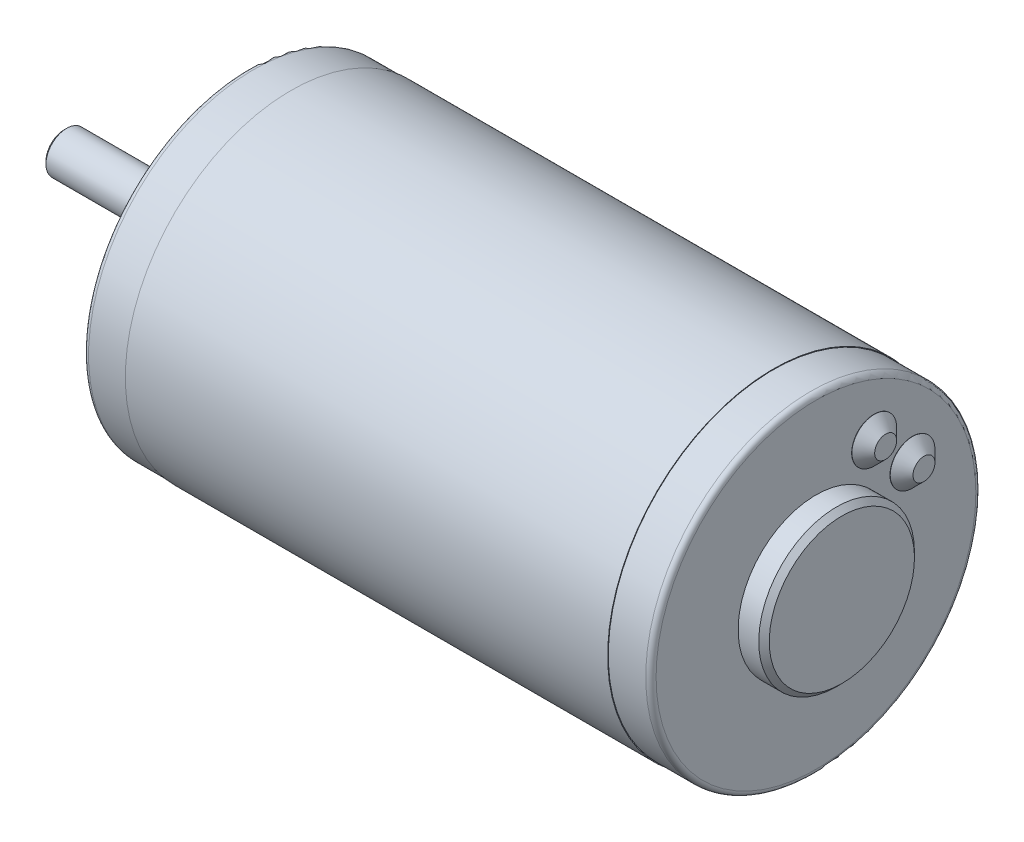
ISO-10303-21;
HEADER;
FILE_DESCRIPTION(('STEP AP214'),'2;1');
FILE_NAME('part.step','',(''),(''),'','','');
FILE_SCHEMA(('AUTOMOTIVE_DESIGN { 1 0 10303 214 1 1 1 1 }'));
ENDSEC;
DATA;
#1=APPLICATION_CONTEXT('core data for automotive mechanical design processes');
#2=APPLICATION_PROTOCOL_DEFINITION('international standard','automotive_design',2000,#1);
#3=PRODUCT_CONTEXT('',#1,'mechanical');
#4=PRODUCT('Part','Part','',(#3));
#5=PRODUCT_RELATED_PRODUCT_CATEGORY('part','',(#4));
#6=PRODUCT_DEFINITION_FORMATION('','',#4);
#7=PRODUCT_DEFINITION_CONTEXT('part definition',#1,'design');
#8=PRODUCT_DEFINITION('design','',#6,#7);
#9=PRODUCT_DEFINITION_SHAPE('','',#8);
#10=(LENGTH_UNIT() NAMED_UNIT(*) SI_UNIT(.MILLI.,.METRE.));
#11=(NAMED_UNIT(*) PLANE_ANGLE_UNIT() SI_UNIT($,.RADIAN.));
#12=(NAMED_UNIT(*) SI_UNIT($,.STERADIAN.) SOLID_ANGLE_UNIT());
#13=UNCERTAINTY_MEASURE_WITH_UNIT(LENGTH_MEASURE(1.E-05),#10,'distance_accuracy_value','');
#14=(GEOMETRIC_REPRESENTATION_CONTEXT(3) GLOBAL_UNCERTAINTY_ASSIGNED_CONTEXT((#13)) GLOBAL_UNIT_ASSIGNED_CONTEXT((#10,
#11,#12)) REPRESENTATION_CONTEXT('',''));
#15=CARTESIAN_POINT('',(0.,0.,0.));
#16=DIRECTION('',(0.,0.,1.));
#17=DIRECTION('',(1.,0.,0.));
#18=AXIS2_PLACEMENT_3D('',#15,#16,#17);
#19=CARTESIAN_POINT('',(-35.6,0.,0.));
#20=DIRECTION('',(-1.,0.,0.));
#21=DIRECTION('',(0.,0.,1.));
#22=AXIS2_PLACEMENT_3D('',#19,#20,#21);
#23=PLANE('',#22);
#24=CARTESIAN_POINT('',(-35.6000000000449,0.,0.));
#25=DIRECTION('',(1.,0.,0.));
#26=DIRECTION('',(0.,0.,-1.));
#27=AXIS2_PLACEMENT_3D('',#24,#25,#26);
#28=CIRCLE('',#27,3.49999999997408);
#29=CARTESIAN_POINT('',(-35.6000000000449,0.,-3.49999999997408));
#30=VERTEX_POINT('',#29);
#31=EDGE_CURVE('E86',#30,#30,#28,.T.);
#32=ORIENTED_EDGE('',*,*,#31,.F.);
#33=EDGE_LOOP('',(#32));
#34=FACE_BOUND('',#33,.T.);
#35=ADVANCED_FACE('F17',(#34),#23,.T.);
#36=CARTESIAN_POINT('',(-27.6,-1.,-2.79999999999999));
#37=DIRECTION('',(0.,0.,1.));
#38=DIRECTION('',(1.,0.,0.));
#39=AXIS2_PLACEMENT_3D('',#36,#37,#38);
#40=PLANE('',#39);
#41=CARTESIAN_POINT('',(-7.1,0.,-2.79999999999999));
#42=DIRECTION('',(0.,0.,-1.));
#43=DIRECTION('',(-1.,0.,0.));
#44=AXIS2_PLACEMENT_3D('',#41,#42,#43);
#45=CIRCLE('',#44,1.);
#46=CARTESIAN_POINT('',(-7.1,1.,-2.79999999999999));
#47=VERTEX_POINT('',#46);
#48=CARTESIAN_POINT('',(-7.1,-1.,-2.79999999999999));
#49=VERTEX_POINT('',#48);
#50=EDGE_CURVE('E355',#47,#49,#45,.T.);
#51=ORIENTED_EDGE('',*,*,#50,.T.);
#52=DIRECTION('',(1.,0.,0.));
#53=VECTOR('',#52,1.);
#54=CARTESIAN_POINT('',(-27.6,-1.,-2.79999999999999));
#55=LINE('',#54,#53);
#56=CARTESIAN_POINT('',(-26.6,-1.,-2.79999999999999));
#57=VERTEX_POINT('',#56);
#58=EDGE_CURVE('E75',#57,#49,#55,.T.);
#59=ORIENTED_EDGE('',*,*,#58,.F.);
#60=CARTESIAN_POINT('',(-26.6,0.,-2.79999999999999));
#61=DIRECTION('',(0.,0.,1.));
#62=DIRECTION('',(1.,0.,0.));
#63=AXIS2_PLACEMENT_3D('',#60,#61,#62);
#64=CIRCLE('',#63,1.);
#65=CARTESIAN_POINT('',(-26.6,1.,-2.79999999999999));
#66=VERTEX_POINT('',#65);
#67=EDGE_CURVE('E77',#57,#66,#64,.F.);
#68=ORIENTED_EDGE('',*,*,#67,.T.);
#69=DIRECTION('',(1.,0.,0.));
#70=VECTOR('',#69,1.);
#71=CARTESIAN_POINT('',(-27.6,1.,-2.79999999999999));
#72=LINE('',#71,#70);
#73=EDGE_CURVE('E80',#66,#47,#72,.T.);
#74=ORIENTED_EDGE('',*,*,#73,.T.);
#75=EDGE_LOOP('',(#51,#59,#68,#74));
#76=FACE_BOUND('',#75,.T.);
#77=ADVANCED_FACE('F79',(#76),#40,.F.);
#78=CARTESIAN_POINT('',(-27.6,1.,-2.79999999999999));
#79=DIRECTION('',(0.,1.,0.));
#80=DIRECTION('',(0.,0.,1.));
#81=AXIS2_PLACEMENT_3D('',#78,#79,#80);
#82=PLANE('',#81);
#83=DIRECTION('',(0.,0.,-1.));
#84=VECTOR('',#83,1.);
#85=CARTESIAN_POINT('',(-7.1,1.,-2.79999999999999));
#86=LINE('',#85,#84);
#87=CARTESIAN_POINT('',(-7.1,1.,-3.87298334620741));
#88=VERTEX_POINT('',#87);
#89=EDGE_CURVE('E94',#88,#47,#86,.F.);
#90=ORIENTED_EDGE('',*,*,#89,.T.);
#91=ORIENTED_EDGE('',*,*,#73,.F.);
#92=DIRECTION('',(0.,0.,1.));
#93=VECTOR('',#92,1.);
#94=CARTESIAN_POINT('',(-26.6,1.,-3.87298334620741));
#95=LINE('',#94,#93);
#96=CARTESIAN_POINT('',(-26.6,1.,-3.87298334620741));
#97=VERTEX_POINT('',#96);
#98=EDGE_CURVE('E85',#66,#97,#95,.F.);
#99=ORIENTED_EDGE('',*,*,#98,.T.);
#100=DIRECTION('',(1.,0.,0.));
#101=VECTOR('',#100,1.);
#102=CARTESIAN_POINT('',(0.,1.,-3.87298334620741));
#103=LINE('',#102,#101);
#104=EDGE_CURVE('E108',#88,#97,#103,.F.);
#105=ORIENTED_EDGE('',*,*,#104,.F.);
#106=EDGE_LOOP('',(#90,#91,#99,#105));
#107=FACE_BOUND('',#106,.T.);
#108=ADVANCED_FACE('F90',(#107),#82,.F.);
#109=CARTESIAN_POINT('',(-35.0999999999999,0.,0.));
#110=DIRECTION('',(1.,0.,0.));
#111=DIRECTION('',(0.,0.,-1.));
#112=AXIS2_PLACEMENT_3D('',#109,#110,#111);
#113=CONICAL_SURFACE('',#112,3.99999999996226,0.785398163340605);
#114=ORIENTED_EDGE('',*,*,#31,.T.);
#115=EDGE_LOOP('',(#114));
#116=FACE_BOUND('',#115,.T.);
#117=CARTESIAN_POINT('',(-35.1,0.,0.));
#118=DIRECTION('',(1.,0.,0.));
#119=DIRECTION('',(0.,0.,-1.));
#120=AXIS2_PLACEMENT_3D('',#117,#118,#119);
#121=CIRCLE('',#120,4.);
#122=CARTESIAN_POINT('',(-35.1,0.,-4.));
#123=VERTEX_POINT('',#122);
#124=EDGE_CURVE('E106',#123,#123,#121,.T.);
#125=ORIENTED_EDGE('',*,*,#124,.F.);
#126=EDGE_LOOP('',(#125));
#127=FACE_BOUND('',#126,.T.);
#128=ADVANCED_FACE('F554',(#116,#127),#113,.T.);
#129=CARTESIAN_POINT('',(-26.6,0.,-3.87298334620741));
#130=DIRECTION('',(0.,0.,1.));
#131=DIRECTION('',(1.,0.,0.));
#132=AXIS2_PLACEMENT_3D('',#129,#130,#131);
#133=CYLINDRICAL_SURFACE('',#132,1.);
#134=CARTESIAN_POINT('',(-26.6,1.,-3.87298334620741));
#135=CARTESIAN_POINT('',(-26.6276629618862,1.00000033683282,-3.87298148578628));
#136=CARTESIAN_POINT('',(-26.6553122166168,0.998851408973519,-3.87328009898513));
#137=CARTESIAN_POINT('',(-26.7104039432582,0.99427130530857,-3.87445904529397));
#138=CARTESIAN_POINT('',(-26.7378464491771,0.990840513520934,-3.87533928052183));
#139=CARTESIAN_POINT('',(-26.8194530833432,0.977175260843417,-3.87881710393726));
#140=CARTESIAN_POINT('',(-26.8730564246123,0.963567703685293,-3.88225202757006));
#141=CARTESIAN_POINT('',(-26.977125593587,0.927797766664205,-3.89095430304382));
#142=CARTESIAN_POINT('',(-27.0275916629555,0.905636046675282,-3.89622151353779));
#143=CARTESIAN_POINT('',(-27.1241130864299,0.853414285079073,-3.90799157486739));
#144=CARTESIAN_POINT('',(-27.1701674100591,0.823352404294525,-3.91449471333242));
#145=CARTESIAN_POINT('',(-27.2575394864378,0.755487979247931,-3.92816193945039));
#146=CARTESIAN_POINT('',(-27.2987466452781,0.717545201468668,-3.9353364874883));
#147=CARTESIAN_POINT('',(-27.374295287631,0.635284227526783,-3.94944965646411));
#148=CARTESIAN_POINT('',(-27.4086343067441,0.590963752716545,-3.95638819197841));
#149=CARTESIAN_POINT('',(-27.4699263913366,0.496434353262424,-3.969365132807));
#150=CARTESIAN_POINT('',(-27.4967663594361,0.446150035120253,-3.97538918749288));
#151=CARTESIAN_POINT('',(-27.5415435234846,0.341642316384397,-3.98572777190495));
#152=CARTESIAN_POINT('',(-27.5594913901323,0.287423727052285,-3.99004434937703));
#153=CARTESIAN_POINT('',(-27.5817561327113,0.194111735626857,-3.99546891720265));
#154=CARTESIAN_POINT('',(-27.5885857933547,0.155632918020193,-3.99715927898668));
#155=CARTESIAN_POINT('',(-27.5977085408135,0.0781080027780982,-3.99942531582645));
#156=CARTESIAN_POINT('',(-27.6000016937716,0.0390619134219042,-4.00000100713419));
#157=CARTESIAN_POINT('',(-27.599997605085,-0.0552317459833931,-3.99999857595864));
#158=CARTESIAN_POINT('',(-27.5954072017814,-0.110495128478836,-3.99884417849431));
#159=CARTESIAN_POINT('',(-27.5771887284744,-0.219452299234418,-3.99434884496973));
#160=CARTESIAN_POINT('',(-27.5635520456883,-0.273144540728258,-3.99100582520556));
#161=CARTESIAN_POINT('',(-27.5277065776784,-0.377348216031198,-3.98250401525138));
#162=CARTESIAN_POINT('',(-27.50550949133,-0.427863881926155,-3.97734770399773));
#163=CARTESIAN_POINT('',(-27.4532106110736,-0.524450982676872,-3.96576858613919));
#164=CARTESIAN_POINT('',(-27.423109018223,-0.57052253053142,-3.9593458117488));
#165=CARTESIAN_POINT('',(-27.3552003629654,-0.657866871057273,-3.94578291730051));
#166=CARTESIAN_POINT('',(-27.3172610821916,-0.699035148909366,-3.93863172676562));
#167=CARTESIAN_POINT('',(-27.2350335448416,-0.774497762760055,-3.92449111086286));
#168=CARTESIAN_POINT('',(-27.19074427933,-0.808791004318421,-3.917501711407));
#169=CARTESIAN_POINT('',(-27.0962571540367,-0.870026617564649,-3.90436326544461));
#170=CARTESIAN_POINT('',(-27.0459800204073,-0.896849892050558,-3.89822853701072));
#171=CARTESIAN_POINT('',(-26.9414633719414,-0.94160949320265,-3.88766043493567));
#172=CARTESIAN_POINT('',(-26.8872268673446,-0.959552492279162,-3.88322578446617));
#173=CARTESIAN_POINT('',(-26.7939162001483,-0.981793057388551,-3.87765011739135));
#174=CARTESIAN_POINT('',(-26.7554596460299,-0.988610024876977,-3.87591131774124));
#175=CARTESIAN_POINT('',(-26.6780089785749,-0.997716332082784,-3.87357302813836));
#176=CARTESIAN_POINT('',(-26.6390152728012,-1.00000893261029,-3.87297271766376));
#177=CARTESIAN_POINT('',(-26.6,-1.,-3.87298334620741));
#178=B_SPLINE_CURVE_WITH_KNOTS('',3,(#134,#135,#136,#137,#138,#139,#140,#141,#142,#143,#144,
#145,#146,#147,#148,#149,#150,#151,#152,#153,#154,#155,#156,#157,#158,#159,#160,#161,#162,#163,
#164,#165,#166,#167,#168,#169,#170,#171,#172,#173,#174,#175,#176,#177),.UNSPECIFIED.,.F.,.F.,(4,
2,2,2,2,2,2,2,2,2,2,2,2,2,2,2,2,2,2,2,2,4),(0.,0.0829364608197381,0.165858967679134,
0.331229962709977,0.496588203456513,0.661984974171246,0.830625162094532,0.999325752711569,
1.17044795789403,1.34136431261154,1.45844938979968,1.57553275986411,1.74108325106591,
1.9067915862414,2.07227425793989,2.23775272086784,2.40629176845251,2.57485762457941,
2.74597444954042,2.91696250578417,3.03398040676348,3.15091393953944),.UNSPECIFIED.);
#179=CARTESIAN_POINT('',(-26.6,-1.,-3.87298334620741));
#180=VERTEX_POINT('',#179);
#181=EDGE_CURVE('E99',#97,#180,#178,.T.);
#182=ORIENTED_EDGE('',*,*,#181,.F.);
#183=ORIENTED_EDGE('',*,*,#98,.F.);
#184=ORIENTED_EDGE('',*,*,#67,.F.);
#185=DIRECTION('',(0.,0.,1.));
#186=VECTOR('',#185,1.);
#187=CARTESIAN_POINT('',(-26.6,-1.,-2.79999999999999));
#188=LINE('',#187,#186);
#189=EDGE_CURVE('E101',#180,#57,#188,.T.);
#190=ORIENTED_EDGE('',*,*,#189,.F.);
#191=EDGE_LOOP('',(#182,#183,#184,#190));
#192=FACE_BOUND('',#191,.T.);
#193=ADVANCED_FACE('F97',(#192),#133,.F.);
#194=CARTESIAN_POINT('',(-27.6,-1.,-2.79999999999999));
#195=DIRECTION('',(0.,1.,0.));
#196=DIRECTION('',(0.,0.,1.));
#197=AXIS2_PLACEMENT_3D('',#194,#195,#196);
#198=PLANE('',#197);
#199=DIRECTION('',(1.,0.,0.));
#200=VECTOR('',#199,1.);
#201=CARTESIAN_POINT('',(0.,-1.,-3.87298334620741));
#202=LINE('',#201,#200);
#203=CARTESIAN_POINT('',(-7.1,-1.,-3.87298334620741));
#204=VERTEX_POINT('',#203);
#205=EDGE_CURVE('E162',#180,#204,#202,.T.);
#206=ORIENTED_EDGE('',*,*,#205,.F.);
#207=ORIENTED_EDGE('',*,*,#189,.T.);
#208=ORIENTED_EDGE('',*,*,#58,.T.);
#209=DIRECTION('',(0.,0.,-1.));
#210=VECTOR('',#209,1.);
#211=CARTESIAN_POINT('',(-7.1,-1.,-2.79999999999999));
#212=LINE('',#211,#210);
#213=EDGE_CURVE('E354',#49,#204,#212,.T.);
#214=ORIENTED_EDGE('',*,*,#213,.T.);
#215=EDGE_LOOP('',(#206,#207,#208,#214));
#216=FACE_BOUND('',#215,.T.);
#217=ADVANCED_FACE('F358',(#216),#198,.T.);
#218=CARTESIAN_POINT('',(-7.1,0.,-2.79999999999999));
#219=DIRECTION('',(0.,0.,-1.));
#220=DIRECTION('',(-1.,0.,0.));
#221=AXIS2_PLACEMENT_3D('',#218,#219,#220);
#222=CYLINDRICAL_SURFACE('',#221,1.);
#223=ORIENTED_EDGE('',*,*,#50,.F.);
#224=ORIENTED_EDGE('',*,*,#89,.F.);
#225=CARTESIAN_POINT('',(-7.1,-1.,-3.87298334620741));
#226=CARTESIAN_POINT('',(-7.07233703811384,-1.00000033683282,-3.87298148578628));
#227=CARTESIAN_POINT('',(-7.04468778338315,-0.998851408973519,-3.87328009898513));
#228=CARTESIAN_POINT('',(-6.98959605674182,-0.994271305308569,-3.87445904529398));
#229=CARTESIAN_POINT('',(-6.96215355082289,-0.990840513520934,-3.87533928052183));
#230=CARTESIAN_POINT('',(-6.88054691665678,-0.977175260843416,-3.87881710393726));
#231=CARTESIAN_POINT('',(-6.82694357538774,-0.963567703685292,-3.88225202757006));
#232=CARTESIAN_POINT('',(-6.72287440641297,-0.927797766664205,-3.89095430304382));
#233=CARTESIAN_POINT('',(-6.67240833704446,-0.905636046675282,-3.89622151353779));
#234=CARTESIAN_POINT('',(-6.57588691357012,-0.853414285079073,-3.90799157486739));
#235=CARTESIAN_POINT('',(-6.52983258994087,-0.823352404294525,-3.91449471333242));
#236=CARTESIAN_POINT('',(-6.44246051356216,-0.755487979247931,-3.92816193945039));
#237=CARTESIAN_POINT('',(-6.40125335472187,-0.717545201468668,-3.9353364874883));
#238=CARTESIAN_POINT('',(-6.32570471236899,-0.635284227526783,-3.94944965646411));
#239=CARTESIAN_POINT('',(-6.29136569325587,-0.590963752716545,-3.95638819197841));
#240=CARTESIAN_POINT('',(-6.23007360866341,-0.496434353262424,-3.969365132807));
#241=CARTESIAN_POINT('',(-6.20323364056389,-0.446150035120253,-3.97538918749288));
#242=CARTESIAN_POINT('',(-6.1584564765154,-0.341642316384397,-3.98572777190495));
#243=CARTESIAN_POINT('',(-6.1405086098677,-0.287423727052285,-3.99004434937703));
#244=CARTESIAN_POINT('',(-6.11824386728865,-0.194111735626858,-3.99546891720265));
#245=CARTESIAN_POINT('',(-6.11141420664531,-0.155632918020193,-3.99715927898668));
#246=CARTESIAN_POINT('',(-6.10229145918653,-0.0781080027780987,-3.99942531582645));
#247=CARTESIAN_POINT('',(-6.09999830622839,-0.0390619134219048,-4.00000100713419));
#248=CARTESIAN_POINT('',(-6.10000239491503,0.0552317459833926,-3.99999857595864));
#249=CARTESIAN_POINT('',(-6.10459279821858,0.110495128478836,-3.99884417849431));
#250=CARTESIAN_POINT('',(-6.12281127152564,0.219452299234417,-3.99434884496973));
#251=CARTESIAN_POINT('',(-6.13644795431172,0.273144540728257,-3.99100582520556));
#252=CARTESIAN_POINT('',(-6.17229342232156,0.377348216031196,-3.98250401525138));
#253=CARTESIAN_POINT('',(-6.19449050867005,0.427863881926154,-3.97734770399773));
#254=CARTESIAN_POINT('',(-6.24678938892637,0.524450982676871,-3.96576858613919));
#255=CARTESIAN_POINT('',(-6.27689098177704,0.570522530531419,-3.95934581174879));
#256=CARTESIAN_POINT('',(-6.34479963703464,0.657866871057273,-3.94578291730051));
#257=CARTESIAN_POINT('',(-6.38273891780836,0.699035148909367,-3.93863172676562));
#258=CARTESIAN_POINT('',(-6.46496645515838,0.774497762760056,-3.92449111086286));
#259=CARTESIAN_POINT('',(-6.50925572067002,0.808791004318422,-3.917501711407));
#260=CARTESIAN_POINT('',(-6.60374284596331,0.870026617564649,-3.90436326544461));
#261=CARTESIAN_POINT('',(-6.65401997959268,0.896849892050559,-3.89822853701072));
#262=CARTESIAN_POINT('',(-6.75853662805855,0.941609493202651,-3.88766043493567));
#263=CARTESIAN_POINT('',(-6.81277313265544,0.959552492279163,-3.88322578446617));
#264=CARTESIAN_POINT('',(-6.90608379985171,0.981793057388551,-3.87765011739135));
#265=CARTESIAN_POINT('',(-6.9445403539701,0.988610024876977,-3.87591131774124));
#266=CARTESIAN_POINT('',(-7.02199102142509,0.997716332082784,-3.87357302813836));
#267=CARTESIAN_POINT('',(-7.06098472719881,1.00000893261029,-3.87297271766376));
#268=CARTESIAN_POINT('',(-7.1,1.,-3.87298334620741));
#269=B_SPLINE_CURVE_WITH_KNOTS('',3,(#225,#226,#227,#228,#229,#230,#231,#232,#233,#234,#235,
#236,#237,#238,#239,#240,#241,#242,#243,#244,#245,#246,#247,#248,#249,#250,#251,#252,#253,#254,
#255,#256,#257,#258,#259,#260,#261,#262,#263,#264,#265,#266,#267,#268),.UNSPECIFIED.,.F.,.F.,(4,
2,2,2,2,2,2,2,2,2,2,2,2,2,2,2,2,2,2,2,2,4),(0.,0.0829364608197424,0.165858967679138,
0.331229962709977,0.496588203456512,0.661984974171246,0.830625162094531,0.999325752711568,
1.17044795789403,1.34136431261154,1.45844938979968,1.57553275986411,1.74108325106591,
1.9067915862414,2.07227425793989,2.23775272086784,2.40629176845251,2.57485762457941,
2.74597444954042,2.91696250578417,3.03398040676347,3.15091393953944),.UNSPECIFIED.);
#270=EDGE_CURVE('E155',#204,#88,#269,.T.);
#271=ORIENTED_EDGE('',*,*,#270,.F.);
#272=ORIENTED_EDGE('',*,*,#213,.F.);
#273=EDGE_LOOP('',(#223,#224,#271,#272));
#274=FACE_BOUND('',#273,.T.);
#275=ADVANCED_FACE('F168',(#274),#222,.F.);
#276=CARTESIAN_POINT('',(0.,0.,0.));
#277=DIRECTION('',(1.,0.,0.));
#278=DIRECTION('',(0.,0.,-1.));
#279=AXIS2_PLACEMENT_3D('',#276,#277,#278);
#280=CYLINDRICAL_SURFACE('',#279,4.);
#281=ORIENTED_EDGE('',*,*,#124,.T.);
#282=EDGE_LOOP('',(#281));
#283=FACE_BOUND('',#282,.T.);
#284=ORIENTED_EDGE('',*,*,#104,.T.);
#285=ORIENTED_EDGE('',*,*,#181,.T.);
#286=ORIENTED_EDGE('',*,*,#205,.T.);
#287=ORIENTED_EDGE('',*,*,#270,.T.);
#288=EDGE_LOOP('',(#284,#285,#286,#287));
#289=FACE_BOUND('',#288,.T.);
#290=CARTESIAN_POINT('',(-4.,0.,0.));
#291=DIRECTION('',(1.,0.,0.));
#292=DIRECTION('',(0.,0.,-1.));
#293=AXIS2_PLACEMENT_3D('',#290,#291,#292);
#294=CIRCLE('',#293,4.);
#295=CARTESIAN_POINT('',(-4.,0.,-4.));
#296=VERTEX_POINT('',#295);
#297=EDGE_CURVE('E152',#296,#296,#294,.T.);
#298=ORIENTED_EDGE('',*,*,#297,.F.);
#299=EDGE_LOOP('',(#298));
#300=FACE_BOUND('',#299,.T.);
#301=ADVANCED_FACE('F171',(#283,#289,#300),#280,.T.);
#302=CARTESIAN_POINT('',(-4.,4.,0.));
#303=DIRECTION('',(-1.,0.,0.));
#304=DIRECTION('',(0.,0.,1.));
#305=AXIS2_PLACEMENT_3D('',#302,#303,#304);
#306=PLANE('',#305);
#307=ORIENTED_EDGE('',*,*,#297,.T.);
#308=EDGE_LOOP('',(#307));
#309=FACE_BOUND('',#308,.T.);
#310=CARTESIAN_POINT('',(-4.,0.,0.));
#311=DIRECTION('',(1.,0.,0.));
#312=DIRECTION('',(0.,1.,0.));
#313=AXIS2_PLACEMENT_3D('',#310,#311,#312);
#314=CIRCLE('',#313,8.509);
#315=CARTESIAN_POINT('',(-4.,8.509,0.));
#316=VERTEX_POINT('',#315);
#317=EDGE_CURVE('E149',#316,#316,#314,.T.);
#318=ORIENTED_EDGE('',*,*,#317,.F.);
#319=EDGE_LOOP('',(#318));
#320=FACE_BOUND('',#319,.T.);
#321=ADVANCED_FACE('F175',(#309,#320),#306,.T.);
#322=CARTESIAN_POINT('',(111.8479,11.2073596390943,-18.6070906828553));
#323=DIRECTION('',(1.,0.,0.));
#324=DIRECTION('',(0.,0.,-1.));
#325=AXIS2_PLACEMENT_3D('',#322,#323,#324);
#326=PLANE('',#325);
#327=CARTESIAN_POINT('',(111.84789999993,11.2073596390943,-18.6070906828553));
#328=DIRECTION('',(-1.,0.,0.));
#329=DIRECTION('',(0.,0.,1.));
#330=AXIS2_PLACEMENT_3D('',#327,#328,#329);
#331=CIRCLE('',#330,2.1180000000021);
#332=CARTESIAN_POINT('',(111.84789999993,11.2073596390943,-16.4890906828532));
#333=VERTEX_POINT('',#332);
#334=EDGE_CURVE('E146',#333,#333,#331,.T.);
#335=ORIENTED_EDGE('',*,*,#334,.F.);
#336=EDGE_LOOP('',(#335));
#337=FACE_BOUND('',#336,.T.);
#338=ADVANCED_FACE('F180',(#337),#326,.T.);
#339=CARTESIAN_POINT('',(111.8479,18.6070906828553,-11.2073596390943));
#340=DIRECTION('',(1.,0.,0.));
#341=DIRECTION('',(0.,0.,-1.));
#342=AXIS2_PLACEMENT_3D('',#339,#340,#341);
#343=PLANE('',#342);
#344=CARTESIAN_POINT('',(111.84789999993,18.6070906828553,-11.2073596390943));
#345=DIRECTION('',(-1.,0.,0.));
#346=DIRECTION('',(0.,-1.,0.));
#347=AXIS2_PLACEMENT_3D('',#344,#345,#346);
#348=CIRCLE('',#347,2.11800000003146);
#349=CARTESIAN_POINT('',(111.84789999993,16.4890906828238,-11.2073596390943));
#350=VERTEX_POINT('',#349);
#351=EDGE_CURVE('E143',#350,#350,#348,.T.);
#352=ORIENTED_EDGE('',*,*,#351,.F.);
#353=EDGE_LOOP('',(#352));
#354=FACE_BOUND('',#353,.T.);
#355=ADVANCED_FACE('F184',(#354),#343,.T.);
#356=CARTESIAN_POINT('',(114.6,15.0368,0.));
#357=DIRECTION('',(1.,0.,0.));
#358=DIRECTION('',(0.,0.,-1.));
#359=AXIS2_PLACEMENT_3D('',#356,#357,#358);
#360=PLANE('',#359);
#361=CARTESIAN_POINT('',(114.6,0.,0.));
#362=DIRECTION('',(-1.,0.,0.));
#363=DIRECTION('',(0.,-1.,0.));
#364=AXIS2_PLACEMENT_3D('',#361,#362,#363);
#365=CIRCLE('',#364,14.0208);
#366=CARTESIAN_POINT('',(114.6,-14.0208,0.));
#367=VERTEX_POINT('',#366);
#368=EDGE_CURVE('E139',#367,#367,#365,.T.);
#369=ORIENTED_EDGE('',*,*,#368,.F.);
#370=EDGE_LOOP('',(#369));
#371=FACE_BOUND('',#370,.T.);
#372=ADVANCED_FACE('F188',(#371),#360,.T.);
#373=CARTESIAN_POINT('',(13.6143999999945,25.4,0.));
#374=DIRECTION('',(-1.,0.,0.));
#375=DIRECTION('',(0.,0.,1.));
#376=AXIS2_PLACEMENT_3D('',#373,#374,#375);
#377=CONICAL_SURFACE('',#376,2.01929999997219,1.02974425867198);
#378=CARTESIAN_POINT('',(14.827717847993,25.4,0.));
#379=VERTEX_POINT('',#378);
#380=VERTEX_LOOP('',#379);
#381=FACE_BOUND('',#380,.T.);
#382=CARTESIAN_POINT('',(13.6144,25.4,0.));
#383=DIRECTION('',(-1.,0.,0.));
#384=DIRECTION('',(0.,0.,1.));
#385=AXIS2_PLACEMENT_3D('',#382,#383,#384);
#386=CIRCLE('',#385,2.0193);
#387=CARTESIAN_POINT('',(13.6144,25.4,2.0193));
#388=VERTEX_POINT('',#387);
#389=EDGE_CURVE('E142',#388,#388,#386,.T.);
#390=ORIENTED_EDGE('',*,*,#389,.T.);
#391=EDGE_LOOP('',(#390));
#392=FACE_BOUND('',#391,.T.);
#393=ADVANCED_FACE('F192',(#381,#392),#377,.F.);
#394=CARTESIAN_POINT('',(13.6143999999945,-25.4,0.));
#395=DIRECTION('',(-1.,0.,0.));
#396=DIRECTION('',(0.,0.,1.));
#397=AXIS2_PLACEMENT_3D('',#394,#395,#396);
#398=CONICAL_SURFACE('',#397,2.01929999997219,1.02974425867198);
#399=CARTESIAN_POINT('',(14.827717847993,-25.4,0.));
#400=VERTEX_POINT('',#399);
#401=VERTEX_LOOP('',#400);
#402=FACE_BOUND('',#401,.T.);
#403=CARTESIAN_POINT('',(13.6144,-25.4,0.));
#404=DIRECTION('',(-1.,0.,0.));
#405=DIRECTION('',(0.,0.,1.));
#406=AXIS2_PLACEMENT_3D('',#403,#404,#405);
#407=CIRCLE('',#406,2.0193);
#408=CARTESIAN_POINT('',(13.6144,-25.4,2.0193));
#409=VERTEX_POINT('',#408);
#410=EDGE_CURVE('E343',#409,#409,#407,.T.);
#411=ORIENTED_EDGE('',*,*,#410,.T.);
#412=EDGE_LOOP('',(#411));
#413=FACE_BOUND('',#412,.T.);
#414=ADVANCED_FACE('F196',(#402,#413),#398,.F.);
#415=CARTESIAN_POINT('',(-2.984,0.,0.));
#416=DIRECTION('',(1.,0.,0.));
#417=DIRECTION('',(0.,1.,0.));
#418=AXIS2_PLACEMENT_3D('',#415,#416,#417);
#419=CONICAL_SURFACE('',#418,9.525,0.78539816339745);
#420=ORIENTED_EDGE('',*,*,#317,.T.);
#421=EDGE_LOOP('',(#420));
#422=FACE_BOUND('',#421,.T.);
#423=CARTESIAN_POINT('',(-2.984,0.,0.));
#424=DIRECTION('',(1.,0.,0.));
#425=DIRECTION('',(0.,0.,-1.));
#426=AXIS2_PLACEMENT_3D('',#423,#424,#425);
#427=CIRCLE('',#426,9.525);
#428=CARTESIAN_POINT('',(-2.984,0.,-9.525));
#429=VERTEX_POINT('',#428);
#430=EDGE_CURVE('E338',#429,#429,#427,.T.);
#431=ORIENTED_EDGE('',*,*,#430,.F.);
#432=EDGE_LOOP('',(#431));
#433=FACE_BOUND('',#432,.T.);
#434=ADVANCED_FACE('F200',(#422,#433),#419,.T.);
#435=CARTESIAN_POINT('',(109.647900000084,11.2073596390943,-18.6070906828553));
#436=DIRECTION('',(-1.,0.,0.));
#437=DIRECTION('',(0.,0.,1.));
#438=AXIS2_PLACEMENT_3D('',#435,#436,#437);
#439=CONICAL_SURFACE('',#438,4.31799999990461,0.785398163410367);
#440=CARTESIAN_POINT('',(109.6479,11.2073596390943,-18.6070906828553));
#441=DIRECTION('',(-1.,0.,0.));
#442=DIRECTION('',(0.,0.,1.));
#443=AXIS2_PLACEMENT_3D('',#440,#441,#442);
#444=CIRCLE('',#443,4.318);
#445=CARTESIAN_POINT('',(109.6479,11.2073596390943,-14.2890906828553));
#446=VERTEX_POINT('',#445);
#447=EDGE_CURVE('E336',#446,#446,#444,.T.);
#448=ORIENTED_EDGE('',*,*,#447,.F.);
#449=EDGE_LOOP('',(#448));
#450=FACE_BOUND('',#449,.T.);
#451=ORIENTED_EDGE('',*,*,#334,.T.);
#452=EDGE_LOOP('',(#451));
#453=FACE_BOUND('',#452,.T.);
#454=ADVANCED_FACE('F204',(#450,#453),#439,.T.);
#455=CARTESIAN_POINT('',(109.647900000027,18.6070906828553,-11.2073596390943));
#456=DIRECTION('',(-1.,0.,0.));
#457=DIRECTION('',(0.,-1.,0.));
#458=AXIS2_PLACEMENT_3D('',#455,#456,#457);
#459=CONICAL_SURFACE('',#458,4.31799999987712,0.785398163384529);
#460=CARTESIAN_POINT('',(109.6479,18.6070906828553,-11.2073596390943));
#461=DIRECTION('',(-1.,0.,0.));
#462=DIRECTION('',(0.,0.,1.));
#463=AXIS2_PLACEMENT_3D('',#460,#461,#462);
#464=CIRCLE('',#463,4.318);
#465=CARTESIAN_POINT('',(109.6479,18.6070906828553,-6.88935963909434));
#466=VERTEX_POINT('',#465);
#467=EDGE_CURVE('E337',#466,#466,#464,.T.);
#468=ORIENTED_EDGE('',*,*,#467,.F.);
#469=EDGE_LOOP('',(#468));
#470=FACE_BOUND('',#469,.T.);
#471=ORIENTED_EDGE('',*,*,#351,.T.);
#472=EDGE_LOOP('',(#471));
#473=FACE_BOUND('',#472,.T.);
#474=ADVANCED_FACE('F208',(#470,#473),#459,.T.);
#475=CARTESIAN_POINT('',(113.584,0.,0.));
#476=DIRECTION('',(-1.,0.,0.));
#477=DIRECTION('',(0.,-1.,0.));
#478=AXIS2_PLACEMENT_3D('',#475,#476,#477);
#479=CONICAL_SURFACE('',#478,15.0368,0.785398163397441);
#480=ORIENTED_EDGE('',*,*,#368,.T.);
#481=EDGE_LOOP('',(#480));
#482=FACE_BOUND('',#481,.T.);
#483=CARTESIAN_POINT('',(113.584,0.,0.));
#484=DIRECTION('',(1.,0.,0.));
#485=DIRECTION('',(0.,0.,-1.));
#486=AXIS2_PLACEMENT_3D('',#483,#484,#485);
#487=CIRCLE('',#486,15.0368);
#488=CARTESIAN_POINT('',(113.584,0.,-15.0368));
#489=VERTEX_POINT('',#488);
#490=EDGE_CURVE('E138',#489,#489,#487,.F.);
#491=ORIENTED_EDGE('',*,*,#490,.F.);
#492=EDGE_LOOP('',(#491));
#493=FACE_BOUND('',#492,.T.);
#494=ADVANCED_FACE('F212',(#482,#493),#479,.T.);
#495=CARTESIAN_POINT('',(0.,25.4,0.));
#496=DIRECTION('',(-1.,0.,0.));
#497=DIRECTION('',(0.,0.,1.));
#498=AXIS2_PLACEMENT_3D('',#495,#496,#497);
#499=CYLINDRICAL_SURFACE('',#498,2.0193);
#500=CARTESIAN_POINT('',(0.,25.4,0.));
#501=DIRECTION('',(-1.,0.,0.));
#502=DIRECTION('',(0.,0.,1.));
#503=AXIS2_PLACEMENT_3D('',#500,#501,#502);
#504=CIRCLE('',#503,2.0193);
#505=CARTESIAN_POINT('',(0.,25.4,2.0193));
#506=VERTEX_POINT('',#505);
#507=EDGE_CURVE('E135',#506,#506,#504,.F.);
#508=ORIENTED_EDGE('',*,*,#507,.F.);
#509=EDGE_LOOP('',(#508));
#510=FACE_BOUND('',#509,.T.);
#511=ORIENTED_EDGE('',*,*,#389,.F.);
#512=EDGE_LOOP('',(#511));
#513=FACE_BOUND('',#512,.T.);
#514=ADVANCED_FACE('F216',(#510,#513),#499,.F.);
#515=CARTESIAN_POINT('',(0.,-25.4,0.));
#516=DIRECTION('',(-1.,0.,0.));
#517=DIRECTION('',(0.,0.,1.));
#518=AXIS2_PLACEMENT_3D('',#515,#516,#517);
#519=CYLINDRICAL_SURFACE('',#518,2.0193);
#520=CARTESIAN_POINT('',(0.,-25.4,0.));
#521=DIRECTION('',(-1.,0.,0.));
#522=DIRECTION('',(0.,0.,1.));
#523=AXIS2_PLACEMENT_3D('',#520,#521,#522);
#524=CIRCLE('',#523,2.0193);
#525=CARTESIAN_POINT('',(0.,-25.4,2.0193));
#526=VERTEX_POINT('',#525);
#527=EDGE_CURVE('E132',#526,#526,#524,.F.);
#528=ORIENTED_EDGE('',*,*,#527,.F.);
#529=EDGE_LOOP('',(#528));
#530=FACE_BOUND('',#529,.T.);
#531=ORIENTED_EDGE('',*,*,#410,.F.);
#532=EDGE_LOOP('',(#531));
#533=FACE_BOUND('',#532,.T.);
#534=ADVANCED_FACE('F220',(#530,#533),#519,.F.);
#535=CARTESIAN_POINT('',(0.,0.,0.));
#536=DIRECTION('',(1.,0.,0.));
#537=DIRECTION('',(0.,0.,-1.));
#538=AXIS2_PLACEMENT_3D('',#535,#536,#537);
#539=CYLINDRICAL_SURFACE('',#538,9.525);
#540=ORIENTED_EDGE('',*,*,#430,.T.);
#541=EDGE_LOOP('',(#540));
#542=FACE_BOUND('',#541,.T.);
#543=CARTESIAN_POINT('',(0.,0.,0.));
#544=DIRECTION('',(1.,0.,0.));
#545=DIRECTION('',(0.,0.,-1.));
#546=AXIS2_PLACEMENT_3D('',#543,#544,#545);
#547=CIRCLE('',#546,9.525);
#548=CARTESIAN_POINT('',(0.,0.,-9.525));
#549=VERTEX_POINT('',#548);
#550=EDGE_CURVE('E129',#549,#549,#547,.T.);
#551=ORIENTED_EDGE('',*,*,#550,.F.);
#552=EDGE_LOOP('',(#551));
#553=FACE_BOUND('',#552,.T.);
#554=ADVANCED_FACE('F224',(#542,#553),#539,.T.);
#555=CARTESIAN_POINT('',(111.8479,11.2073596390943,-18.6070906828553));
#556=DIRECTION('',(-1.,0.,0.));
#557=DIRECTION('',(0.,0.,1.));
#558=AXIS2_PLACEMENT_3D('',#555,#556,#557);
#559=CYLINDRICAL_SURFACE('',#558,4.318);
#560=CARTESIAN_POINT('',(109.6,11.2073596390943,-18.6070906828553));
#561=DIRECTION('',(-1.,0.,0.));
#562=DIRECTION('',(0.,0.,1.));
#563=AXIS2_PLACEMENT_3D('',#560,#561,#562);
#564=CIRCLE('',#563,4.318);
#565=CARTESIAN_POINT('',(109.6,11.2073596390943,-14.2890906828553));
#566=VERTEX_POINT('',#565);
#567=EDGE_CURVE('E126',#566,#566,#564,.T.);
#568=ORIENTED_EDGE('',*,*,#567,.F.);
#569=EDGE_LOOP('',(#568));
#570=FACE_BOUND('',#569,.T.);
#571=ORIENTED_EDGE('',*,*,#447,.T.);
#572=EDGE_LOOP('',(#571));
#573=FACE_BOUND('',#572,.T.);
#574=ADVANCED_FACE('F228',(#570,#573),#559,.T.);
#575=CARTESIAN_POINT('',(111.8479,18.6070906828553,-11.2073596390943));
#576=DIRECTION('',(-1.,0.,0.));
#577=DIRECTION('',(0.,0.,1.));
#578=AXIS2_PLACEMENT_3D('',#575,#576,#577);
#579=CYLINDRICAL_SURFACE('',#578,4.318);
#580=CARTESIAN_POINT('',(109.6,18.6070906828553,-11.2073596390943));
#581=DIRECTION('',(-1.,0.,0.));
#582=DIRECTION('',(0.,0.,1.));
#583=AXIS2_PLACEMENT_3D('',#580,#581,#582);
#584=CIRCLE('',#583,4.318);
#585=CARTESIAN_POINT('',(109.6,18.6070906828553,-6.88935963909434));
#586=VERTEX_POINT('',#585);
#587=EDGE_CURVE('E123',#586,#586,#584,.T.);
#588=ORIENTED_EDGE('',*,*,#587,.F.);
#589=EDGE_LOOP('',(#588));
#590=FACE_BOUND('',#589,.T.);
#591=ORIENTED_EDGE('',*,*,#467,.T.);
#592=EDGE_LOOP('',(#591));
#593=FACE_BOUND('',#592,.T.);
#594=ADVANCED_FACE('F232',(#590,#593),#579,.T.);
#595=CARTESIAN_POINT('',(0.,0.,0.));
#596=DIRECTION('',(1.,0.,0.));
#597=DIRECTION('',(0.,0.,-1.));
#598=AXIS2_PLACEMENT_3D('',#595,#596,#597);
#599=CYLINDRICAL_SURFACE('',#598,15.0368);
#600=CARTESIAN_POINT('',(109.6,0.,0.));
#601=DIRECTION('',(1.,0.,0.));
#602=DIRECTION('',(0.,0.,-1.));
#603=AXIS2_PLACEMENT_3D('',#600,#601,#602);
#604=CIRCLE('',#603,15.0368);
#605=CARTESIAN_POINT('',(109.6,0.,-15.0368));
#606=VERTEX_POINT('',#605);
#607=EDGE_CURVE('E119',#606,#606,#604,.F.);
#608=ORIENTED_EDGE('',*,*,#607,.F.);
#609=EDGE_LOOP('',(#608));
#610=FACE_BOUND('',#609,.T.);
#611=ORIENTED_EDGE('',*,*,#490,.T.);
#612=EDGE_LOOP('',(#611));
#613=FACE_BOUND('',#612,.T.);
#614=ADVANCED_FACE('F236',(#610,#613),#599,.T.);
#615=CARTESIAN_POINT('',(0.,9.525,0.));
#616=DIRECTION('',(-1.,0.,0.));
#617=DIRECTION('',(0.,0.,1.));
#618=AXIS2_PLACEMENT_3D('',#615,#616,#617);
#619=PLANE('',#618);
#620=ORIENTED_EDGE('',*,*,#550,.T.);
#621=EDGE_LOOP('',(#620));
#622=FACE_BOUND('',#621,.T.);
#623=CARTESIAN_POINT('',(0.,0.,0.));
#624=DIRECTION('',(1.,0.,0.));
#625=DIRECTION('',(0.,0.,-1.));
#626=AXIS2_PLACEMENT_3D('',#623,#624,#625);
#627=CIRCLE('',#626,30.877);
#628=CARTESIAN_POINT('',(0.,0.,-30.877));
#629=VERTEX_POINT('',#628);
#630=CARTESIAN_POINT('',(0.,0.,30.877));
#631=VERTEX_POINT('',#630);
#632=EDGE_CURVE('E122',#629,#631,#627,.T.);
#633=ORIENTED_EDGE('',*,*,#632,.F.);
#634=CARTESIAN_POINT('',(0.,0.,0.));
#635=DIRECTION('',(1.,0.,0.));
#636=DIRECTION('',(0.,0.,1.));
#637=AXIS2_PLACEMENT_3D('',#634,#635,#636);
#638=CIRCLE('',#637,30.877);
#639=EDGE_CURVE('E267',#631,#629,#638,.T.);
#640=ORIENTED_EDGE('',*,*,#639,.F.);
#641=EDGE_LOOP('',(#633,#640));
#642=FACE_BOUND('',#641,.T.);
#643=ORIENTED_EDGE('',*,*,#527,.T.);
#644=EDGE_LOOP('',(#643));
#645=FACE_BOUND('',#644,.T.);
#646=ORIENTED_EDGE('',*,*,#507,.T.);
#647=EDGE_LOOP('',(#646));
#648=FACE_BOUND('',#647,.T.);
#649=ADVANCED_FACE('F240',(#622,#642,#645,#648),#619,.T.);
#650=CARTESIAN_POINT('',(109.6,31.877,0.));
#651=DIRECTION('',(1.,0.,0.));
#652=DIRECTION('',(0.,0.,-1.));
#653=AXIS2_PLACEMENT_3D('',#650,#651,#652);
#654=PLANE('',#653);
#655=ORIENTED_EDGE('',*,*,#607,.T.);
#656=EDGE_LOOP('',(#655));
#657=FACE_BOUND('',#656,.T.);
#658=CARTESIAN_POINT('',(109.6,0.,0.));
#659=DIRECTION('',(-1.,0.,0.));
#660=DIRECTION('',(0.,0.,1.));
#661=AXIS2_PLACEMENT_3D('',#658,#659,#660);
#662=CIRCLE('',#661,30.877);
#663=CARTESIAN_POINT('',(109.6,0.,30.877));
#664=VERTEX_POINT('',#663);
#665=CARTESIAN_POINT('',(109.6,0.,-30.877));
#666=VERTEX_POINT('',#665);
#667=EDGE_CURVE('E36',#664,#666,#662,.T.);
#668=ORIENTED_EDGE('',*,*,#667,.F.);
#669=CARTESIAN_POINT('',(109.6,0.,0.));
#670=DIRECTION('',(-1.,0.,0.));
#671=DIRECTION('',(0.,0.,-1.));
#672=AXIS2_PLACEMENT_3D('',#669,#670,#671);
#673=CIRCLE('',#672,30.877);
#674=EDGE_CURVE('E270',#666,#664,#673,.T.);
#675=ORIENTED_EDGE('',*,*,#674,.F.);
#676=EDGE_LOOP('',(#668,#675));
#677=FACE_BOUND('',#676,.T.);
#678=ORIENTED_EDGE('',*,*,#587,.T.);
#679=EDGE_LOOP('',(#678));
#680=FACE_BOUND('',#679,.T.);
#681=ORIENTED_EDGE('',*,*,#567,.T.);
#682=EDGE_LOOP('',(#681));
#683=FACE_BOUND('',#682,.T.);
#684=ADVANCED_FACE('F245',(#657,#677,#680,#683),#654,.T.);
#685=CARTESIAN_POINT('',(0.999999999999999,0.,0.));
#686=DIRECTION('',(-1.,0.,0.));
#687=DIRECTION('',(0.,0.,1.));
#688=AXIS2_PLACEMENT_3D('',#685,#686,#687);
#689=TOROIDAL_SURFACE('',#688,30.877,1.);
#690=CARTESIAN_POINT('',(0.999999999999999,0.,0.));
#691=DIRECTION('',(1.,0.,0.));
#692=DIRECTION('',(0.,0.,-1.));
#693=AXIS2_PLACEMENT_3D('',#690,#691,#692);
#694=CIRCLE('',#693,31.877);
#695=CARTESIAN_POINT('',(0.999999999999999,0.,-31.877));
#696=VERTEX_POINT('',#695);
#697=EDGE_CURVE('E297',#696,#696,#694,.T.);
#698=ORIENTED_EDGE('',*,*,#697,.F.);
#699=EDGE_LOOP('',(#698));
#700=FACE_BOUND('',#699,.T.);
#701=ORIENTED_EDGE('',*,*,#639,.T.);
#702=ORIENTED_EDGE('',*,*,#632,.T.);
#703=EDGE_LOOP('',(#701,#702));
#704=FACE_BOUND('',#703,.T.);
#705=ADVANCED_FACE('F271',(#700,#704),#689,.T.);
#706=CARTESIAN_POINT('',(108.6,0.,0.));
#707=DIRECTION('',(1.,0.,0.));
#708=DIRECTION('',(0.,0.,-1.));
#709=AXIS2_PLACEMENT_3D('',#706,#707,#708);
#710=TOROIDAL_SURFACE('',#709,30.877,1.);
#711=CARTESIAN_POINT('',(108.6,0.,0.));
#712=DIRECTION('',(1.,0.,0.));
#713=DIRECTION('',(0.,0.,-1.));
#714=AXIS2_PLACEMENT_3D('',#711,#712,#713);
#715=CIRCLE('',#714,31.877);
#716=CARTESIAN_POINT('',(108.6,0.,-31.877));
#717=VERTEX_POINT('',#716);
#718=EDGE_CURVE('E118',#717,#717,#715,.F.);
#719=ORIENTED_EDGE('',*,*,#718,.F.);
#720=EDGE_LOOP('',(#719));
#721=FACE_BOUND('',#720,.T.);
#722=ORIENTED_EDGE('',*,*,#674,.T.);
#723=ORIENTED_EDGE('',*,*,#667,.T.);
#724=EDGE_LOOP('',(#722,#723));
#725=FACE_BOUND('',#724,.T.);
#726=ADVANCED_FACE('F277',(#721,#725),#710,.T.);
#727=CARTESIAN_POINT('',(0.,0.,0.));
#728=DIRECTION('',(1.,0.,0.));
#729=DIRECTION('',(0.,0.,-1.));
#730=AXIS2_PLACEMENT_3D('',#727,#728,#729);
#731=CYLINDRICAL_SURFACE('',#730,31.877);
#732=ORIENTED_EDGE('',*,*,#697,.T.);
#733=EDGE_LOOP('',(#732));
#734=FACE_BOUND('',#733,.T.);
#735=CARTESIAN_POINT('',(8.2296,0.,0.));
#736=DIRECTION('',(1.,0.,0.));
#737=DIRECTION('',(0.,0.,-1.));
#738=AXIS2_PLACEMENT_3D('',#735,#736,#737);
#739=CIRCLE('',#738,31.877);
#740=CARTESIAN_POINT('',(8.2296,0.,-31.877));
#741=VERTEX_POINT('',#740);
#742=EDGE_CURVE('E115',#741,#741,#739,.T.);
#743=ORIENTED_EDGE('',*,*,#742,.F.);
#744=EDGE_LOOP('',(#743));
#745=FACE_BOUND('',#744,.T.);
#746=ADVANCED_FACE('F287',(#734,#745),#731,.T.);
#747=CARTESIAN_POINT('',(0.,0.,0.));
#748=DIRECTION('',(1.,0.,0.));
#749=DIRECTION('',(0.,0.,-1.));
#750=AXIS2_PLACEMENT_3D('',#747,#748,#749);
#751=CYLINDRICAL_SURFACE('',#750,31.877);
#752=CARTESIAN_POINT('',(101.3704,0.,0.));
#753=DIRECTION('',(1.,0.,0.));
#754=DIRECTION('',(0.,0.,-1.));
#755=AXIS2_PLACEMENT_3D('',#752,#753,#754);
#756=CIRCLE('',#755,31.877);
#757=CARTESIAN_POINT('',(101.3704,0.,-31.877));
#758=VERTEX_POINT('',#757);
#759=EDGE_CURVE('E112',#758,#758,#756,.F.);
#760=ORIENTED_EDGE('',*,*,#759,.F.);
#761=EDGE_LOOP('',(#760));
#762=FACE_BOUND('',#761,.T.);
#763=ORIENTED_EDGE('',*,*,#718,.T.);
#764=EDGE_LOOP('',(#763));
#765=FACE_BOUND('',#764,.T.);
#766=ADVANCED_FACE('F383',(#762,#765),#751,.T.);
#767=CARTESIAN_POINT('',(8.2296,31.877,0.));
#768=DIRECTION('',(-1.,0.,0.));
#769=DIRECTION('',(0.,0.,1.));
#770=AXIS2_PLACEMENT_3D('',#767,#768,#769);
#771=PLANE('',#770);
#772=CARTESIAN_POINT('',(8.2296,0.,0.));
#773=DIRECTION('',(1.,0.,0.));
#774=DIRECTION('',(0.,0.,-1.));
#775=AXIS2_PLACEMENT_3D('',#772,#773,#774);
#776=CIRCLE('',#775,32.004);
#777=CARTESIAN_POINT('',(8.2296,0.,-32.004));
#778=VERTEX_POINT('',#777);
#779=EDGE_CURVE('E28',#778,#778,#776,.T.);
#780=ORIENTED_EDGE('',*,*,#779,.F.);
#781=EDGE_LOOP('',(#780));
#782=FACE_BOUND('',#781,.T.);
#783=ORIENTED_EDGE('',*,*,#742,.T.);
#784=EDGE_LOOP('',(#783));
#785=FACE_BOUND('',#784,.T.);
#786=ADVANCED_FACE('F377',(#782,#785),#771,.T.);
#787=CARTESIAN_POINT('',(101.3704,32.004,0.));
#788=DIRECTION('',(1.,0.,0.));
#789=DIRECTION('',(0.,0.,-1.));
#790=AXIS2_PLACEMENT_3D('',#787,#788,#789);
#791=PLANE('',#790);
#792=ORIENTED_EDGE('',*,*,#759,.T.);
#793=EDGE_LOOP('',(#792));
#794=FACE_BOUND('',#793,.T.);
#795=CARTESIAN_POINT('',(101.3704,0.,0.));
#796=DIRECTION('',(1.,0.,0.));
#797=DIRECTION('',(0.,0.,-1.));
#798=AXIS2_PLACEMENT_3D('',#795,#796,#797);
#799=CIRCLE('',#798,32.004);
#800=CARTESIAN_POINT('',(101.3704,0.,-32.004));
#801=VERTEX_POINT('',#800);
#802=EDGE_CURVE('E11',#801,#801,#799,.F.);
#803=ORIENTED_EDGE('',*,*,#802,.F.);
#804=EDGE_LOOP('',(#803));
#805=FACE_BOUND('',#804,.T.);
#806=ADVANCED_FACE('F371',(#794,#805),#791,.T.);
#807=CARTESIAN_POINT('',(0.,0.,0.));
#808=DIRECTION('',(1.,0.,0.));
#809=DIRECTION('',(0.,0.,-1.));
#810=AXIS2_PLACEMENT_3D('',#807,#808,#809);
#811=CYLINDRICAL_SURFACE('',#810,32.004);
#812=ORIENTED_EDGE('',*,*,#802,.T.);
#813=EDGE_LOOP('',(#812));
#814=FACE_BOUND('',#813,.T.);
#815=ORIENTED_EDGE('',*,*,#779,.T.);
#816=EDGE_LOOP('',(#815));
#817=FACE_BOUND('',#816,.T.);
#818=ADVANCED_FACE('F369',(#814,#817),#811,.T.);
#819=CLOSED_SHELL('',(#35,#77,#108,#128,#193,#217,#275,#301,#321,#338,#355,#372,#393,#414,#434,
#454,#474,#494,#514,#534,#554,#574,#594,#614,#649,#684,#705,#726,#746,#766,#786,#806,#818));
#820=MANIFOLD_SOLID_BREP('B1',#819);
#821=ADVANCED_BREP_SHAPE_REPRESENTATION('',(#18,#820),#14);
#822=SHAPE_DEFINITION_REPRESENTATION(#9,#821);
ENDSEC;
END-ISO-10303-21;
